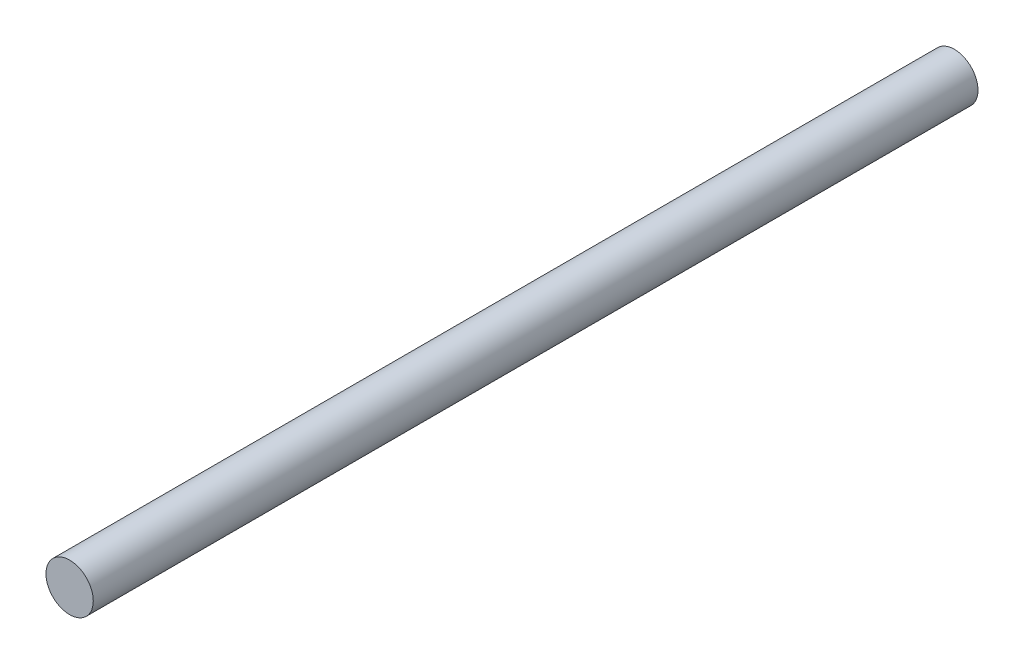
ISO-10303-21;
HEADER;
FILE_DESCRIPTION(('STEP AP214'),'2;1');
FILE_NAME('part.step','',(''),(''),'','','');
FILE_SCHEMA(('AUTOMOTIVE_DESIGN { 1 0 10303 214 1 1 1 1 }'));
ENDSEC;
DATA;
#1=APPLICATION_CONTEXT('core data for automotive mechanical design processes');
#2=APPLICATION_PROTOCOL_DEFINITION('international standard','automotive_design',2000,#1);
#3=PRODUCT_CONTEXT('',#1,'mechanical');
#4=PRODUCT('Part','Part','',(#3));
#5=PRODUCT_RELATED_PRODUCT_CATEGORY('part','',(#4));
#6=PRODUCT_DEFINITION_FORMATION('','',#4);
#7=PRODUCT_DEFINITION_CONTEXT('part definition',#1,'design');
#8=PRODUCT_DEFINITION('design','',#6,#7);
#9=PRODUCT_DEFINITION_SHAPE('','',#8);
#10=(LENGTH_UNIT() NAMED_UNIT(*) SI_UNIT(.MILLI.,.METRE.));
#11=(NAMED_UNIT(*) PLANE_ANGLE_UNIT() SI_UNIT($,.RADIAN.));
#12=(NAMED_UNIT(*) SI_UNIT($,.STERADIAN.) SOLID_ANGLE_UNIT());
#13=UNCERTAINTY_MEASURE_WITH_UNIT(LENGTH_MEASURE(1.E-05),#10,'distance_accuracy_value','');
#14=(GEOMETRIC_REPRESENTATION_CONTEXT(3) GLOBAL_UNCERTAINTY_ASSIGNED_CONTEXT((#13)) GLOBAL_UNIT_ASSIGNED_CONTEXT((#10,
#11,#12)) REPRESENTATION_CONTEXT('',''));
#15=CARTESIAN_POINT('',(0.,0.,0.));
#16=DIRECTION('',(0.,0.,1.));
#17=DIRECTION('',(1.,0.,0.));
#18=AXIS2_PLACEMENT_3D('',#15,#16,#17);
#19=CARTESIAN_POINT('',(0.,0.,215.));
#20=DIRECTION('',(0.,0.,-1.));
#21=DIRECTION('',(-1.,0.,0.));
#22=AXIS2_PLACEMENT_3D('',#19,#20,#21);
#23=CYLINDRICAL_SURFACE('',#22,11.5);
#24=CARTESIAN_POINT('',(0.,0.,215.));
#25=DIRECTION('',(0.,0.,1.));
#26=DIRECTION('',(1.,0.,0.));
#27=AXIS2_PLACEMENT_3D('',#24,#25,#26);
#28=CIRCLE('',#27,11.5);
#29=CARTESIAN_POINT('',(11.5,0.,215.));
#30=VERTEX_POINT('',#29);
#31=EDGE_CURVE('E10',#30,#30,#28,.T.);
#32=ORIENTED_EDGE('',*,*,#31,.F.);
#33=EDGE_LOOP('',(#32));
#34=FACE_BOUND('',#33,.T.);
#35=CARTESIAN_POINT('',(0.,0.,-215.));
#36=DIRECTION('',(0.,0.,1.));
#37=DIRECTION('',(1.,0.,0.));
#38=AXIS2_PLACEMENT_3D('',#35,#36,#37);
#39=CIRCLE('',#38,11.5);
#40=CARTESIAN_POINT('',(11.5,0.,-215.));
#41=VERTEX_POINT('',#40);
#42=EDGE_CURVE('E44',#41,#41,#39,.T.);
#43=ORIENTED_EDGE('',*,*,#42,.T.);
#44=EDGE_LOOP('',(#43));
#45=FACE_BOUND('',#44,.T.);
#46=ADVANCED_FACE('F41',(#34,#45),#23,.T.);
#47=CARTESIAN_POINT('',(0.,0.,215.));
#48=DIRECTION('',(0.,0.,1.));
#49=DIRECTION('',(1.,0.,0.));
#50=AXIS2_PLACEMENT_3D('',#47,#48,#49);
#51=PLANE('',#50);
#52=ORIENTED_EDGE('',*,*,#31,.T.);
#53=EDGE_LOOP('',(#52));
#54=FACE_BOUND('',#53,.T.);
#55=ADVANCED_FACE('F58',(#54),#51,.T.);
#56=CARTESIAN_POINT('',(0.,0.,-215.));
#57=DIRECTION('',(0.,0.,1.));
#58=DIRECTION('',(1.,0.,0.));
#59=AXIS2_PLACEMENT_3D('',#56,#57,#58);
#60=PLANE('',#59);
#61=ORIENTED_EDGE('',*,*,#42,.F.);
#62=EDGE_LOOP('',(#61));
#63=FACE_BOUND('',#62,.T.);
#64=ADVANCED_FACE('F56',(#63),#60,.F.);
#65=CLOSED_SHELL('',(#46,#55,#64));
#66=MANIFOLD_SOLID_BREP('B2',#65);
#67=ADVANCED_BREP_SHAPE_REPRESENTATION('',(#18,#66),#14);
#68=SHAPE_DEFINITION_REPRESENTATION(#9,#67);
ENDSEC;
END-ISO-10303-21;
